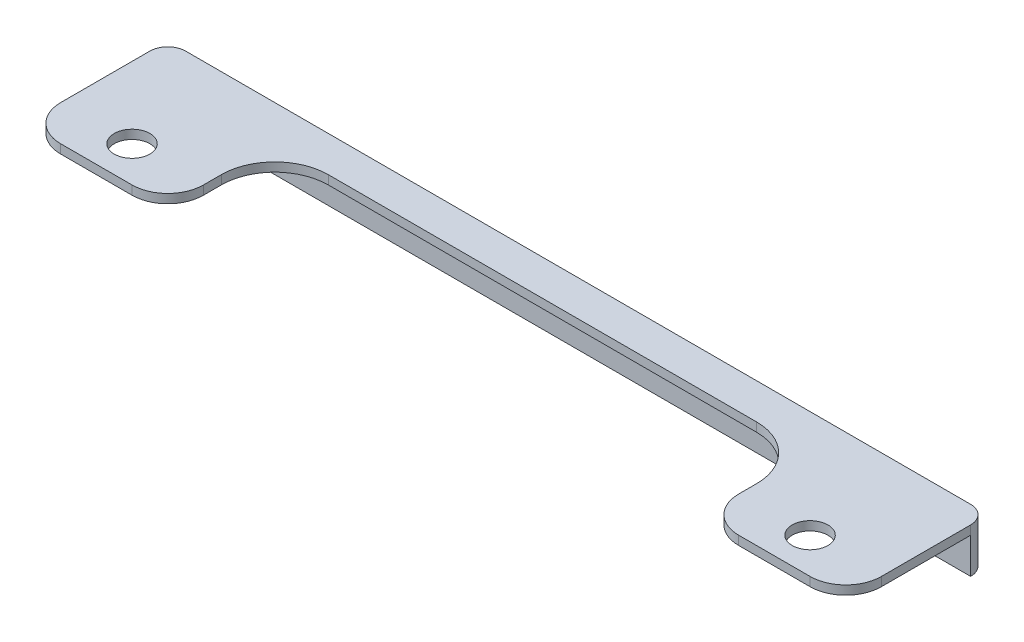
ISO-10303-21;
HEADER;
FILE_DESCRIPTION(('STEP AP214'),'2;1');
FILE_NAME('part.step','',(''),(''),'','','');
FILE_SCHEMA(('AUTOMOTIVE_DESIGN { 1 0 10303 214 1 1 1 1 }'));
ENDSEC;
DATA;
#1=APPLICATION_CONTEXT('core data for automotive mechanical design processes');
#2=APPLICATION_PROTOCOL_DEFINITION('international standard','automotive_design',2000,#1);
#3=PRODUCT_CONTEXT('',#1,'mechanical');
#4=PRODUCT('Part','Part','',(#3));
#5=PRODUCT_RELATED_PRODUCT_CATEGORY('part','',(#4));
#6=PRODUCT_DEFINITION_FORMATION('','',#4);
#7=PRODUCT_DEFINITION_CONTEXT('part definition',#1,'design');
#8=PRODUCT_DEFINITION('design','',#6,#7);
#9=PRODUCT_DEFINITION_SHAPE('','',#8);
#10=(LENGTH_UNIT() NAMED_UNIT(*) SI_UNIT(.MILLI.,.METRE.));
#11=(NAMED_UNIT(*) PLANE_ANGLE_UNIT() SI_UNIT($,.RADIAN.));
#12=(NAMED_UNIT(*) SI_UNIT($,.STERADIAN.) SOLID_ANGLE_UNIT());
#13=UNCERTAINTY_MEASURE_WITH_UNIT(LENGTH_MEASURE(1.E-05),#10,'distance_accuracy_value','');
#14=(GEOMETRIC_REPRESENTATION_CONTEXT(3) GLOBAL_UNCERTAINTY_ASSIGNED_CONTEXT((#13)) GLOBAL_UNIT_ASSIGNED_CONTEXT((#10,
#11,#12)) REPRESENTATION_CONTEXT('',''));
#15=CARTESIAN_POINT('',(0.,0.,0.));
#16=DIRECTION('',(0.,0.,1.));
#17=DIRECTION('',(1.,0.,0.));
#18=AXIS2_PLACEMENT_3D('',#15,#16,#17);
#19=CARTESIAN_POINT('',(0.,-40.,-103.273036008075));
#20=DIRECTION('',(0.,0.,1.));
#21=DIRECTION('',(1.,0.,0.));
#22=AXIS2_PLACEMENT_3D('',#19,#20,#21);
#23=PLANE('',#22);
#24=DIRECTION('',(1.,0.,0.));
#25=VECTOR('',#24,1.);
#26=CARTESIAN_POINT('',(0.,0.,-103.273036008075));
#27=LINE('',#26,#25);
#28=CARTESIAN_POINT('',(-73.0488390004261,0.,-103.273036008075));
#29=VERTEX_POINT('',#28);
#30=CARTESIAN_POINT('',(146.951160999574,0.,-103.273036008075));
#31=VERTEX_POINT('',#30);
#32=EDGE_CURVE('E289',#29,#31,#27,.T.);
#33=ORIENTED_EDGE('',*,*,#32,.T.);
#34=DIRECTION('',(0.,-1.,0.));
#35=VECTOR('',#34,1.);
#36=CARTESIAN_POINT('',(146.951160999574,-40.,-103.273036008075));
#37=LINE('',#36,#35);
#38=CARTESIAN_POINT('',(146.951160999574,-12.5,-103.273036008075));
#39=VERTEX_POINT('',#38);
#40=EDGE_CURVE('E292',#31,#39,#37,.T.);
#41=ORIENTED_EDGE('',*,*,#40,.T.);
#42=DIRECTION('',(1.,0.,0.));
#43=VECTOR('',#42,1.);
#44=CARTESIAN_POINT('',(0.,-12.5,-103.273036008075));
#45=LINE('',#44,#43);
#46=CARTESIAN_POINT('',(-73.0488390004261,-12.5,-103.273036008075));
#47=VERTEX_POINT('',#46);
#48=EDGE_CURVE('E282',#47,#39,#45,.T.);
#49=ORIENTED_EDGE('',*,*,#48,.F.);
#50=DIRECTION('',(0.,1.,0.));
#51=VECTOR('',#50,1.);
#52=CARTESIAN_POINT('',(-73.0488390004261,-40.,-103.273036008075));
#53=LINE('',#52,#51);
#54=EDGE_CURVE('E287',#47,#29,#53,.T.);
#55=ORIENTED_EDGE('',*,*,#54,.T.);
#56=EDGE_LOOP('',(#33,#41,#49,#55));
#57=FACE_BOUND('',#56,.T.);
#58=ADVANCED_FACE('F34',(#57),#23,.F.);
#59=CARTESIAN_POINT('',(0.,0.,-98.2730360080746));
#60=DIRECTION('',(0.,0.,1.));
#61=DIRECTION('',(1.,0.,0.));
#62=AXIS2_PLACEMENT_3D('',#59,#60,#61);
#63=PLANE('',#62);
#64=DIRECTION('',(0.,1.,0.));
#65=VECTOR('',#64,1.);
#66=CARTESIAN_POINT('',(-78.0488390004261,0.,-98.2730360080746));
#67=LINE('',#66,#65);
#68=CARTESIAN_POINT('',(-78.0488390004261,-12.5,-98.2730360080746));
#69=VERTEX_POINT('',#68);
#70=CARTESIAN_POINT('',(-78.0488390004261,-2.49999999999997,-98.2730360080746));
#71=VERTEX_POINT('',#70);
#72=EDGE_CURVE('E164',#69,#71,#67,.T.);
#73=ORIENTED_EDGE('',*,*,#72,.F.);
#74=DIRECTION('',(1.,0.,0.));
#75=VECTOR('',#74,1.);
#76=CARTESIAN_POINT('',(0.,-12.5,-98.2730360080746));
#77=LINE('',#76,#75);
#78=CARTESIAN_POINT('',(151.951160999574,-12.5,-98.2730360080746));
#79=VERTEX_POINT('',#78);
#80=EDGE_CURVE('E175',#69,#79,#77,.T.);
#81=ORIENTED_EDGE('',*,*,#80,.T.);
#82=DIRECTION('',(0.,-1.,0.));
#83=VECTOR('',#82,1.);
#84=CARTESIAN_POINT('',(151.951160999574,0.,-98.2730360080746));
#85=LINE('',#84,#83);
#86=CARTESIAN_POINT('',(151.951160999574,-2.49999999999997,-98.2730360080746));
#87=VERTEX_POINT('',#86);
#88=EDGE_CURVE('E165',#87,#79,#85,.T.);
#89=ORIENTED_EDGE('',*,*,#88,.F.);
#90=DIRECTION('',(-1.,0.,0.));
#91=VECTOR('',#90,1.);
#92=CARTESIAN_POINT('',(0.,-2.5,-98.2730360080746));
#93=LINE('',#92,#91);
#94=EDGE_CURVE('E172',#87,#71,#93,.T.);
#95=ORIENTED_EDGE('',*,*,#94,.T.);
#96=EDGE_LOOP('',(#73,#81,#89,#95));
#97=FACE_BOUND('',#96,.T.);
#98=ADVANCED_FACE('F171',(#97),#63,.T.);
#99=CARTESIAN_POINT('',(0.,0.,0.));
#100=DIRECTION('',(0.,1.,0.));
#101=DIRECTION('',(0.,0.,1.));
#102=AXIS2_PLACEMENT_3D('',#99,#100,#101);
#103=PLANE('',#102);
#104=CARTESIAN_POINT('',(131.951160999574,0.,-73.2730360080746));
#105=DIRECTION('',(0.,1.,0.));
#106=DIRECTION('',(0.,0.,1.));
#107=AXIS2_PLACEMENT_3D('',#104,#105,#106);
#108=CIRCLE('',#107,5.00000000000002);
#109=CARTESIAN_POINT('',(131.951160999574,0.,-68.2730360080745));
#110=VERTEX_POINT('',#109);
#111=EDGE_CURVE('E241',#110,#110,#108,.T.);
#112=ORIENTED_EDGE('',*,*,#111,.F.);
#113=EDGE_LOOP('',(#112));
#114=FACE_BOUND('',#113,.T.);
#115=CARTESIAN_POINT('',(-58.0488390004261,0.,-73.2730360080746));
#116=DIRECTION('',(0.,1.,0.));
#117=DIRECTION('',(0.,0.,1.));
#118=AXIS2_PLACEMENT_3D('',#115,#116,#117);
#119=CIRCLE('',#118,5.);
#120=CARTESIAN_POINT('',(-58.0488390004261,0.,-68.2730360080746));
#121=VERTEX_POINT('',#120);
#122=EDGE_CURVE('E574',#121,#121,#119,.T.);
#123=ORIENTED_EDGE('',*,*,#122,.F.);
#124=EDGE_LOOP('',(#123));
#125=FACE_BOUND('',#124,.T.);
#126=DIRECTION('',(0.,0.,-1.));
#127=VECTOR('',#126,1.);
#128=CARTESIAN_POINT('',(111.951160999575,0.,-7.76817228595287E-13));
#129=LINE('',#128,#127);
#130=CARTESIAN_POINT('',(111.951160999574,0.,-73.2730360080745));
#131=VERTEX_POINT('',#130);
#132=CARTESIAN_POINT('',(111.951160999574,0.,-78.273036008075));
#133=VERTEX_POINT('',#132);
#134=EDGE_CURVE('E268',#131,#133,#129,.T.);
#135=ORIENTED_EDGE('',*,*,#134,.F.);
#136=CARTESIAN_POINT('',(121.951160999574,0.,-73.2730360080746));
#137=DIRECTION('',(0.,1.,0.));
#138=DIRECTION('',(0.,0.,1.));
#139=AXIS2_PLACEMENT_3D('',#136,#137,#138);
#140=CIRCLE('',#139,10.);
#141=CARTESIAN_POINT('',(121.951160999574,0.,-63.2730360080746));
#142=VERTEX_POINT('',#141);
#143=EDGE_CURVE('E222',#131,#142,#140,.T.);
#144=ORIENTED_EDGE('',*,*,#143,.T.);
#145=DIRECTION('',(-1.,0.,0.));
#146=VECTOR('',#145,1.);
#147=CARTESIAN_POINT('',(-78.0488390004261,0.,-63.2730360080746));
#148=LINE('',#147,#146);
#149=CARTESIAN_POINT('',(141.951160999574,0.,-63.2730360080746));
#150=VERTEX_POINT('',#149);
#151=EDGE_CURVE('E240',#150,#142,#148,.T.);
#152=ORIENTED_EDGE('',*,*,#151,.F.);
#153=CARTESIAN_POINT('',(141.951160999574,0.,-73.2730360080746));
#154=DIRECTION('',(0.,1.,0.));
#155=DIRECTION('',(0.,0.,1.));
#156=AXIS2_PLACEMENT_3D('',#153,#154,#155);
#157=CIRCLE('',#156,10.);
#158=CARTESIAN_POINT('',(151.951160999574,0.,-73.2730360080746));
#159=VERTEX_POINT('',#158);
#160=EDGE_CURVE('E220',#150,#159,#157,.T.);
#161=ORIENTED_EDGE('',*,*,#160,.T.);
#162=DIRECTION('',(0.,0.,1.));
#163=VECTOR('',#162,1.);
#164=CARTESIAN_POINT('',(151.951160999574,0.,-108.83068140399));
#165=LINE('',#164,#163);
#166=CARTESIAN_POINT('',(151.951160999574,0.,-98.2730360080746));
#167=VERTEX_POINT('',#166);
#168=EDGE_CURVE('E338',#167,#159,#165,.T.);
#169=ORIENTED_EDGE('',*,*,#168,.F.);
#170=CARTESIAN_POINT('',(146.951160999574,0.,-98.2730360080746));
#171=DIRECTION('',(0.,1.,0.));
#172=DIRECTION('',(0.,0.,1.));
#173=AXIS2_PLACEMENT_3D('',#170,#171,#172);
#174=CIRCLE('',#173,5.);
#175=EDGE_CURVE('E189',#167,#31,#174,.T.);
#176=ORIENTED_EDGE('',*,*,#175,.T.);
#177=ORIENTED_EDGE('',*,*,#32,.F.);
#178=CARTESIAN_POINT('',(-73.0488390004261,0.,-98.2730360080746));
#179=DIRECTION('',(0.,1.,0.));
#180=DIRECTION('',(0.,0.,1.));
#181=AXIS2_PLACEMENT_3D('',#178,#179,#180);
#182=CIRCLE('',#181,5.);
#183=CARTESIAN_POINT('',(-78.0488390004261,0.,-98.2730360080746));
#184=VERTEX_POINT('',#183);
#185=EDGE_CURVE('E190',#29,#184,#182,.T.);
#186=ORIENTED_EDGE('',*,*,#185,.T.);
#187=DIRECTION('',(0.,0.,-1.));
#188=VECTOR('',#187,1.);
#189=CARTESIAN_POINT('',(-78.0488390004261,0.,-104.16866880405));
#190=LINE('',#189,#188);
#191=CARTESIAN_POINT('',(-78.0488390004261,0.,-73.2730360080746));
#192=VERTEX_POINT('',#191);
#193=EDGE_CURVE('E177',#192,#184,#190,.T.);
#194=ORIENTED_EDGE('',*,*,#193,.F.);
#195=CARTESIAN_POINT('',(-68.0488390004261,0.,-73.2730360080746));
#196=DIRECTION('',(0.,1.,0.));
#197=DIRECTION('',(0.,0.,1.));
#198=AXIS2_PLACEMENT_3D('',#195,#196,#197);
#199=CIRCLE('',#198,10.);
#200=CARTESIAN_POINT('',(-68.0488390004261,0.,-63.2730360080746));
#201=VERTEX_POINT('',#200);
#202=EDGE_CURVE('E55',#192,#201,#199,.T.);
#203=ORIENTED_EDGE('',*,*,#202,.T.);
#204=CARTESIAN_POINT('',(-48.0488390004261,0.,-63.2730360080746));
#205=VERTEX_POINT('',#204);
#206=EDGE_CURVE('E233',#205,#201,#148,.T.);
#207=ORIENTED_EDGE('',*,*,#206,.F.);
#208=CARTESIAN_POINT('',(-48.0488390004261,0.,-73.2730360080746));
#209=DIRECTION('',(0.,1.,0.));
#210=DIRECTION('',(0.,0.,1.));
#211=AXIS2_PLACEMENT_3D('',#208,#209,#210);
#212=CIRCLE('',#211,10.);
#213=CARTESIAN_POINT('',(-38.0488390004261,0.,-73.2730360080746));
#214=VERTEX_POINT('',#213);
#215=EDGE_CURVE('E49',#205,#214,#212,.T.);
#216=ORIENTED_EDGE('',*,*,#215,.T.);
#217=DIRECTION('',(0.,0.,-1.));
#218=VECTOR('',#217,1.);
#219=CARTESIAN_POINT('',(-38.0488390004261,0.,0.));
#220=LINE('',#219,#218);
#221=CARTESIAN_POINT('',(-38.0488390004261,0.,-78.2730360080745));
#222=VERTEX_POINT('',#221);
#223=EDGE_CURVE('E251',#214,#222,#220,.T.);
#224=ORIENTED_EDGE('',*,*,#223,.T.);
#225=CARTESIAN_POINT('',(-23.0488390004261,0.,-78.2730360080746));
#226=DIRECTION('',(0.,1.,0.));
#227=DIRECTION('',(0.,0.,1.));
#228=AXIS2_PLACEMENT_3D('',#225,#226,#227);
#229=CIRCLE('',#228,15.);
#230=CARTESIAN_POINT('',(-23.048839000426,0.,-93.2730360080746));
#231=VERTEX_POINT('',#230);
#232=EDGE_CURVE('E260',#222,#231,#229,.F.);
#233=ORIENTED_EDGE('',*,*,#232,.T.);
#234=DIRECTION('',(1.,0.,0.));
#235=VECTOR('',#234,1.);
#236=CARTESIAN_POINT('',(-3.19291105804638E-13,0.,-93.2730360080747));
#237=LINE('',#236,#235);
#238=CARTESIAN_POINT('',(96.9511609995742,0.,-93.273036008075));
#239=VERTEX_POINT('',#238);
#240=EDGE_CURVE('E256',#231,#239,#237,.T.);
#241=ORIENTED_EDGE('',*,*,#240,.T.);
#242=CARTESIAN_POINT('',(96.9511609995743,0.,-78.273036008075));
#243=DIRECTION('',(0.,1.,0.));
#244=DIRECTION('',(0.,0.,1.));
#245=AXIS2_PLACEMENT_3D('',#242,#243,#244);
#246=CIRCLE('',#245,15.);
#247=EDGE_CURVE('E184',#239,#133,#246,.F.);
#248=ORIENTED_EDGE('',*,*,#247,.T.);
#249=EDGE_LOOP('',(#135,#144,#152,#161,#169,#176,#177,#186,#194,#203,#207,#216,#224,#233,#241,#248));
#250=FACE_BOUND('',#249,.T.);
#251=ADVANCED_FACE('F239',(#114,#125,#250),#103,.T.);
#252=CARTESIAN_POINT('',(0.,-2.5,-98.2730360080746));
#253=DIRECTION('',(0.,1.,0.));
#254=DIRECTION('',(-1.,0.,0.));
#255=AXIS2_PLACEMENT_3D('',#252,#253,#254);
#256=PLANE('',#255);
#257=CARTESIAN_POINT('',(131.951160999574,-2.49999999999998,-73.2730360080746));
#258=DIRECTION('',(0.,-1.,0.));
#259=DIRECTION('',(1.,0.,0.));
#260=AXIS2_PLACEMENT_3D('',#257,#258,#259);
#261=CIRCLE('',#260,5.00000000000002);
#262=CARTESIAN_POINT('',(136.951160999574,-2.49999999999998,-73.2730360080746));
#263=VERTEX_POINT('',#262);
#264=EDGE_CURVE('E573',#263,#263,#261,.T.);
#265=ORIENTED_EDGE('',*,*,#264,.F.);
#266=EDGE_LOOP('',(#265));
#267=FACE_BOUND('',#266,.T.);
#268=CARTESIAN_POINT('',(-58.0488390004261,-2.50000000000001,-73.2730360080746));
#269=DIRECTION('',(0.,-1.,0.));
#270=DIRECTION('',(1.,0.,0.));
#271=AXIS2_PLACEMENT_3D('',#268,#269,#270);
#272=CIRCLE('',#271,5.);
#273=CARTESIAN_POINT('',(-53.0488390004261,-2.5,-73.2730360080746));
#274=VERTEX_POINT('',#273);
#275=EDGE_CURVE('E575',#274,#274,#272,.T.);
#276=ORIENTED_EDGE('',*,*,#275,.F.);
#277=EDGE_LOOP('',(#276));
#278=FACE_BOUND('',#277,.T.);
#279=DIRECTION('',(-1.,0.,0.));
#280=VECTOR('',#279,1.);
#281=CARTESIAN_POINT('',(0.,-2.5,-63.2730360080746));
#282=LINE('',#281,#280);
#283=CARTESIAN_POINT('',(141.951160999574,-2.49999999999998,-63.2730360080746));
#284=VERTEX_POINT('',#283);
#285=CARTESIAN_POINT('',(121.951160999574,-2.49999999999998,-63.2730360080746));
#286=VERTEX_POINT('',#285);
#287=EDGE_CURVE('E333',#284,#286,#282,.T.);
#288=ORIENTED_EDGE('',*,*,#287,.T.);
#289=CARTESIAN_POINT('',(121.951160999574,-2.49999999999998,-73.2730360080746));
#290=DIRECTION('',(0.,1.,0.));
#291=DIRECTION('',(-1.,0.,0.));
#292=AXIS2_PLACEMENT_3D('',#289,#290,#291);
#293=CIRCLE('',#292,10.);
#294=CARTESIAN_POINT('',(111.951160999574,-2.5,-73.2730360080745));
#295=VERTEX_POINT('',#294);
#296=EDGE_CURVE('E214',#286,#295,#293,.F.);
#297=ORIENTED_EDGE('',*,*,#296,.T.);
#298=DIRECTION('',(0.,0.,-1.));
#299=VECTOR('',#298,1.);
#300=CARTESIAN_POINT('',(111.951160999575,-2.5,-7.76817228595287E-13));
#301=LINE('',#300,#299);
#302=CARTESIAN_POINT('',(111.951160999574,-2.5,-78.273036008075));
#303=VERTEX_POINT('',#302);
#304=EDGE_CURVE('E255',#295,#303,#301,.T.);
#305=ORIENTED_EDGE('',*,*,#304,.T.);
#306=CARTESIAN_POINT('',(96.9511609995743,-2.5,-78.273036008075));
#307=DIRECTION('',(0.,1.,0.));
#308=DIRECTION('',(0.,0.,1.));
#309=AXIS2_PLACEMENT_3D('',#306,#307,#308);
#310=CIRCLE('',#309,15.);
#311=CARTESIAN_POINT('',(96.9511609995742,-2.5,-93.273036008075));
#312=VERTEX_POINT('',#311);
#313=EDGE_CURVE('E272',#312,#303,#310,.F.);
#314=ORIENTED_EDGE('',*,*,#313,.F.);
#315=DIRECTION('',(1.,0.,0.));
#316=VECTOR('',#315,1.);
#317=CARTESIAN_POINT('',(0.,-2.50000000000002,-93.2730360080747));
#318=LINE('',#317,#316);
#319=CARTESIAN_POINT('',(-23.048839000426,-2.5,-93.2730360080746));
#320=VERTEX_POINT('',#319);
#321=EDGE_CURVE('E258',#320,#312,#318,.T.);
#322=ORIENTED_EDGE('',*,*,#321,.F.);
#323=CARTESIAN_POINT('',(-23.0488390004261,-2.5,-78.2730360080746));
#324=DIRECTION('',(0.,1.,0.));
#325=DIRECTION('',(0.,0.,1.));
#326=AXIS2_PLACEMENT_3D('',#323,#324,#325);
#327=CIRCLE('',#326,15.);
#328=CARTESIAN_POINT('',(-38.0488390004261,-2.5,-78.2730360080745));
#329=VERTEX_POINT('',#328);
#330=EDGE_CURVE('E254',#329,#320,#327,.F.);
#331=ORIENTED_EDGE('',*,*,#330,.F.);
#332=DIRECTION('',(0.,0.,1.));
#333=VECTOR('',#332,1.);
#334=CARTESIAN_POINT('',(-38.0488390004261,-2.5,-98.2730360080746));
#335=LINE('',#334,#333);
#336=CARTESIAN_POINT('',(-38.0488390004261,-2.5,-73.2730360080746));
#337=VERTEX_POINT('',#336);
#338=EDGE_CURVE('E250',#329,#337,#335,.T.);
#339=ORIENTED_EDGE('',*,*,#338,.T.);
#340=CARTESIAN_POINT('',(-48.0488390004261,-2.5,-73.2730360080746));
#341=DIRECTION('',(0.,1.,0.));
#342=DIRECTION('',(-1.,0.,0.));
#343=AXIS2_PLACEMENT_3D('',#340,#341,#342);
#344=CIRCLE('',#343,10.);
#345=CARTESIAN_POINT('',(-48.0488390004261,-2.5,-63.2730360080746));
#346=VERTEX_POINT('',#345);
#347=EDGE_CURVE('E210',#337,#346,#344,.F.);
#348=ORIENTED_EDGE('',*,*,#347,.T.);
#349=CARTESIAN_POINT('',(-68.0488390004261,-2.50000000000001,-63.2730360080746));
#350=VERTEX_POINT('',#349);
#351=EDGE_CURVE('E236',#346,#350,#282,.T.);
#352=ORIENTED_EDGE('',*,*,#351,.T.);
#353=CARTESIAN_POINT('',(-68.0488390004261,-2.5,-73.2730360080746));
#354=DIRECTION('',(0.,1.,0.));
#355=DIRECTION('',(-1.,0.,0.));
#356=AXIS2_PLACEMENT_3D('',#353,#354,#355);
#357=CIRCLE('',#356,10.);
#358=CARTESIAN_POINT('',(-78.0488390004261,-2.50000000000001,-73.2730360080746));
#359=VERTEX_POINT('',#358);
#360=EDGE_CURVE('E208',#350,#359,#357,.F.);
#361=ORIENTED_EDGE('',*,*,#360,.T.);
#362=DIRECTION('',(0.,0.,-1.));
#363=VECTOR('',#362,1.);
#364=CARTESIAN_POINT('',(-78.0488390004261,-2.50000000000001,-98.2730360080745));
#365=LINE('',#364,#363);
#366=EDGE_CURVE('E182',#359,#71,#365,.T.);
#367=ORIENTED_EDGE('',*,*,#366,.T.);
#368=ORIENTED_EDGE('',*,*,#94,.F.);
#369=DIRECTION('',(0.,0.,1.));
#370=VECTOR('',#369,1.);
#371=CARTESIAN_POINT('',(151.951160999574,-2.49999999999998,-98.2730360080746));
#372=LINE('',#371,#370);
#373=CARTESIAN_POINT('',(151.951160999574,-2.49999999999998,-73.2730360080746));
#374=VERTEX_POINT('',#373);
#375=EDGE_CURVE('E152',#87,#374,#372,.T.);
#376=ORIENTED_EDGE('',*,*,#375,.T.);
#377=CARTESIAN_POINT('',(141.951160999574,-2.49999999999997,-73.2730360080746));
#378=DIRECTION('',(0.,1.,0.));
#379=DIRECTION('',(-1.,0.,0.));
#380=AXIS2_PLACEMENT_3D('',#377,#378,#379);
#381=CIRCLE('',#380,10.);
#382=EDGE_CURVE('E212',#374,#284,#381,.F.);
#383=ORIENTED_EDGE('',*,*,#382,.T.);
#384=EDGE_LOOP('',(#288,#297,#305,#314,#322,#331,#339,#348,#352,#361,#367,#368,#376,#383));
#385=FACE_BOUND('',#384,.T.);
#386=ADVANCED_FACE('F180',(#267,#278,#385),#256,.F.);
#387=CARTESIAN_POINT('',(-3.19291105804638E-13,-40.,-93.2730360080747));
#388=DIRECTION('',(0.,0.,1.));
#389=DIRECTION('',(1.,0.,0.));
#390=AXIS2_PLACEMENT_3D('',#387,#388,#389);
#391=PLANE('',#390);
#392=ORIENTED_EDGE('',*,*,#240,.F.);
#393=DIRECTION('',(0.,1.,0.));
#394=VECTOR('',#393,1.);
#395=CARTESIAN_POINT('',(-23.048839000426,-2.5,-93.2730360080746));
#396=LINE('',#395,#394);
#397=EDGE_CURVE('E279',#320,#231,#396,.T.);
#398=ORIENTED_EDGE('',*,*,#397,.F.);
#399=ORIENTED_EDGE('',*,*,#321,.T.);
#400=DIRECTION('',(0.,1.,0.));
#401=VECTOR('',#400,1.);
#402=CARTESIAN_POINT('',(96.9511609995742,-2.5,-93.273036008075));
#403=LINE('',#402,#401);
#404=EDGE_CURVE('E265',#312,#239,#403,.T.);
#405=ORIENTED_EDGE('',*,*,#404,.T.);
#406=EDGE_LOOP('',(#392,#398,#399,#405));
#407=FACE_BOUND('',#406,.T.);
#408=ADVANCED_FACE('F323',(#407),#391,.T.);
#409=CARTESIAN_POINT('',(111.951160999575,-40.,-7.76817228595287E-13));
#410=DIRECTION('',(1.,0.,0.));
#411=DIRECTION('',(0.,0.,-1.));
#412=AXIS2_PLACEMENT_3D('',#409,#410,#411);
#413=PLANE('',#412);
#414=ORIENTED_EDGE('',*,*,#304,.F.);
#415=DIRECTION('',(0.,-1.,0.));
#416=VECTOR('',#415,1.);
#417=CARTESIAN_POINT('',(111.951160999574,-40.,-73.2730360080745));
#418=LINE('',#417,#416);
#419=EDGE_CURVE('E216',#295,#131,#418,.F.);
#420=ORIENTED_EDGE('',*,*,#419,.T.);
#421=ORIENTED_EDGE('',*,*,#134,.T.);
#422=DIRECTION('',(0.,1.,0.));
#423=VECTOR('',#422,1.);
#424=CARTESIAN_POINT('',(111.951160999574,-2.5,-78.273036008075));
#425=LINE('',#424,#423);
#426=EDGE_CURVE('E269',#303,#133,#425,.T.);
#427=ORIENTED_EDGE('',*,*,#426,.F.);
#428=EDGE_LOOP('',(#414,#420,#421,#427));
#429=FACE_BOUND('',#428,.T.);
#430=ADVANCED_FACE('F311',(#429),#413,.F.);
#431=CARTESIAN_POINT('',(-38.0488390004261,-40.,0.));
#432=DIRECTION('',(1.,0.,0.));
#433=DIRECTION('',(0.,0.,-1.));
#434=AXIS2_PLACEMENT_3D('',#431,#432,#433);
#435=PLANE('',#434);
#436=ORIENTED_EDGE('',*,*,#223,.F.);
#437=DIRECTION('',(0.,-1.,0.));
#438=VECTOR('',#437,1.);
#439=CARTESIAN_POINT('',(-38.0488390004261,-2.5,-73.2730360080746));
#440=LINE('',#439,#438);
#441=EDGE_CURVE('E225',#214,#337,#440,.T.);
#442=ORIENTED_EDGE('',*,*,#441,.T.);
#443=ORIENTED_EDGE('',*,*,#338,.F.);
#444=DIRECTION('',(0.,1.,0.));
#445=VECTOR('',#444,1.);
#446=CARTESIAN_POINT('',(-38.0488390004261,-2.5,-78.2730360080745));
#447=LINE('',#446,#445);
#448=EDGE_CURVE('E277',#329,#222,#447,.T.);
#449=ORIENTED_EDGE('',*,*,#448,.T.);
#450=EDGE_LOOP('',(#436,#442,#443,#449));
#451=FACE_BOUND('',#450,.T.);
#452=ADVANCED_FACE('F248',(#451),#435,.T.);
#453=CARTESIAN_POINT('',(96.9511609995743,-2.5,-78.273036008075));
#454=DIRECTION('',(0.,1.,0.));
#455=DIRECTION('',(0.,0.,1.));
#456=AXIS2_PLACEMENT_3D('',#453,#454,#455);
#457=CYLINDRICAL_SURFACE('',#456,15.);
#458=ORIENTED_EDGE('',*,*,#247,.F.);
#459=ORIENTED_EDGE('',*,*,#404,.F.);
#460=ORIENTED_EDGE('',*,*,#313,.T.);
#461=ORIENTED_EDGE('',*,*,#426,.T.);
#462=EDGE_LOOP('',(#458,#459,#460,#461));
#463=FACE_BOUND('',#462,.T.);
#464=ADVANCED_FACE('F316',(#463),#457,.F.);
#465=CARTESIAN_POINT('',(-23.0488390004261,-2.5,-78.2730360080746));
#466=DIRECTION('',(0.,1.,0.));
#467=DIRECTION('',(0.,0.,1.));
#468=AXIS2_PLACEMENT_3D('',#465,#466,#467);
#469=CYLINDRICAL_SURFACE('',#468,15.);
#470=ORIENTED_EDGE('',*,*,#232,.F.);
#471=ORIENTED_EDGE('',*,*,#448,.F.);
#472=ORIENTED_EDGE('',*,*,#330,.T.);
#473=ORIENTED_EDGE('',*,*,#397,.T.);
#474=EDGE_LOOP('',(#470,#471,#472,#473));
#475=FACE_BOUND('',#474,.T.);
#476=ADVANCED_FACE('F453',(#475),#469,.F.);
#477=CARTESIAN_POINT('',(0.,-12.5,-108.273036008075));
#478=DIRECTION('',(0.,-1.,0.));
#479=DIRECTION('',(0.,0.,-1.));
#480=AXIS2_PLACEMENT_3D('',#477,#478,#479);
#481=PLANE('',#480);
#482=ORIENTED_EDGE('',*,*,#48,.T.);
#483=CARTESIAN_POINT('',(146.951160999574,-12.5,-98.2730360080746));
#484=DIRECTION('',(0.,-1.,0.));
#485=DIRECTION('',(0.,0.,-1.));
#486=AXIS2_PLACEMENT_3D('',#483,#484,#485);
#487=CIRCLE('',#486,5.);
#488=EDGE_CURVE('E191',#39,#79,#487,.T.);
#489=ORIENTED_EDGE('',*,*,#488,.T.);
#490=ORIENTED_EDGE('',*,*,#80,.F.);
#491=CARTESIAN_POINT('',(-73.0488390004261,-12.5,-98.2730360080746));
#492=DIRECTION('',(0.,-1.,0.));
#493=DIRECTION('',(0.,0.,-1.));
#494=AXIS2_PLACEMENT_3D('',#491,#492,#493);
#495=CIRCLE('',#494,5.);
#496=EDGE_CURVE('E195',#69,#47,#495,.T.);
#497=ORIENTED_EDGE('',*,*,#496,.T.);
#498=EDGE_LOOP('',(#482,#489,#490,#497));
#499=FACE_BOUND('',#498,.T.);
#500=ADVANCED_FACE('F297',(#499),#481,.T.);
#501=CARTESIAN_POINT('',(151.951160999574,-50.,-108.83068140399));
#502=DIRECTION('',(-1.,0.,0.));
#503=DIRECTION('',(0.,0.,1.));
#504=AXIS2_PLACEMENT_3D('',#501,#502,#503);
#505=PLANE('',#504);
#506=ORIENTED_EDGE('',*,*,#168,.T.);
#507=DIRECTION('',(0.,1.,0.));
#508=VECTOR('',#507,1.);
#509=CARTESIAN_POINT('',(151.951160999574,-50.,-73.2730360080746));
#510=LINE('',#509,#508);
#511=EDGE_CURVE('E160',#159,#374,#510,.F.);
#512=ORIENTED_EDGE('',*,*,#511,.T.);
#513=ORIENTED_EDGE('',*,*,#375,.F.);
#514=DIRECTION('',(0.,-1.,0.));
#515=VECTOR('',#514,1.);
#516=CARTESIAN_POINT('',(151.951160999574,-50.,-98.2730360080746));
#517=LINE('',#516,#515);
#518=EDGE_CURVE('E157',#87,#167,#517,.F.);
#519=ORIENTED_EDGE('',*,*,#518,.T.);
#520=EDGE_LOOP('',(#506,#512,#513,#519));
#521=FACE_BOUND('',#520,.T.);
#522=ADVANCED_FACE('F155',(#521),#505,.F.);
#523=CARTESIAN_POINT('',(-78.0488390004261,-50.,-104.16866880405));
#524=DIRECTION('',(1.,0.,0.));
#525=DIRECTION('',(0.,0.,-1.));
#526=AXIS2_PLACEMENT_3D('',#523,#524,#525);
#527=PLANE('',#526);
#528=ORIENTED_EDGE('',*,*,#366,.F.);
#529=DIRECTION('',(0.,1.,0.));
#530=VECTOR('',#529,1.);
#531=CARTESIAN_POINT('',(-78.0488390004261,-50.,-73.2730360080746));
#532=LINE('',#531,#530);
#533=EDGE_CURVE('E11',#359,#192,#532,.T.);
#534=ORIENTED_EDGE('',*,*,#533,.T.);
#535=ORIENTED_EDGE('',*,*,#193,.T.);
#536=DIRECTION('',(0.,1.,0.));
#537=VECTOR('',#536,1.);
#538=CARTESIAN_POINT('',(-78.0488390004261,-50.,-98.2730360080746));
#539=LINE('',#538,#537);
#540=EDGE_CURVE('E200',#184,#71,#539,.F.);
#541=ORIENTED_EDGE('',*,*,#540,.T.);
#542=EDGE_LOOP('',(#528,#534,#535,#541));
#543=FACE_BOUND('',#542,.T.);
#544=ADVANCED_FACE('F445',(#543),#527,.F.);
#545=CARTESIAN_POINT('',(-78.0488390004261,-50.,-63.2730360080746));
#546=DIRECTION('',(0.,0.,-1.));
#547=DIRECTION('',(-1.,0.,0.));
#548=AXIS2_PLACEMENT_3D('',#545,#546,#547);
#549=PLANE('',#548);
#550=ORIENTED_EDGE('',*,*,#351,.F.);
#551=DIRECTION('',(0.,-1.,0.));
#552=VECTOR('',#551,1.);
#553=CARTESIAN_POINT('',(-48.0488390004261,0.,-63.2730360080746));
#554=LINE('',#553,#552);
#555=EDGE_CURVE('E42',#346,#205,#554,.F.);
#556=ORIENTED_EDGE('',*,*,#555,.T.);
#557=ORIENTED_EDGE('',*,*,#206,.T.);
#558=DIRECTION('',(0.,1.,0.));
#559=VECTOR('',#558,1.);
#560=CARTESIAN_POINT('',(-68.0488390004261,-50.,-63.2730360080746));
#561=LINE('',#560,#559);
#562=EDGE_CURVE('E228',#201,#350,#561,.F.);
#563=ORIENTED_EDGE('',*,*,#562,.T.);
#564=EDGE_LOOP('',(#550,#556,#557,#563));
#565=FACE_BOUND('',#564,.T.);
#566=ADVANCED_FACE('F232',(#565),#549,.F.);
#567=ORIENTED_EDGE('',*,*,#151,.T.);
#568=DIRECTION('',(0.,-1.,0.));
#569=VECTOR('',#568,1.);
#570=CARTESIAN_POINT('',(121.951160999574,-50.,-63.2730360080746));
#571=LINE('',#570,#569);
#572=EDGE_CURVE('E205',#142,#286,#571,.T.);
#573=ORIENTED_EDGE('',*,*,#572,.T.);
#574=ORIENTED_EDGE('',*,*,#287,.F.);
#575=DIRECTION('',(0.,1.,0.));
#576=VECTOR('',#575,1.);
#577=CARTESIAN_POINT('',(141.951160999574,-50.,-63.2730360080746));
#578=LINE('',#577,#576);
#579=EDGE_CURVE('E202',#284,#150,#578,.T.);
#580=ORIENTED_EDGE('',*,*,#579,.T.);
#581=EDGE_LOOP('',(#567,#573,#574,#580));
#582=FACE_BOUND('',#581,.T.);
#583=ADVANCED_FACE('F330',(#582),#549,.F.);
#584=CARTESIAN_POINT('',(146.951160999574,-40.,-98.2730360080746));
#585=DIRECTION('',(0.,-1.,0.));
#586=DIRECTION('',(0.,0.,-1.));
#587=AXIS2_PLACEMENT_3D('',#584,#585,#586);
#588=CYLINDRICAL_SURFACE('',#587,5.);
#589=ORIENTED_EDGE('',*,*,#518,.F.);
#590=ORIENTED_EDGE('',*,*,#88,.T.);
#591=ORIENTED_EDGE('',*,*,#488,.F.);
#592=ORIENTED_EDGE('',*,*,#40,.F.);
#593=ORIENTED_EDGE('',*,*,#175,.F.);
#594=EDGE_LOOP('',(#589,#590,#591,#592,#593));
#595=FACE_BOUND('',#594,.T.);
#596=ADVANCED_FACE('F187',(#595),#588,.T.);
#597=CARTESIAN_POINT('',(-73.0488390004261,-40.,-98.2730360080746));
#598=DIRECTION('',(0.,1.,0.));
#599=DIRECTION('',(0.,0.,1.));
#600=AXIS2_PLACEMENT_3D('',#597,#598,#599);
#601=CYLINDRICAL_SURFACE('',#600,5.);
#602=ORIENTED_EDGE('',*,*,#72,.T.);
#603=ORIENTED_EDGE('',*,*,#540,.F.);
#604=ORIENTED_EDGE('',*,*,#185,.F.);
#605=ORIENTED_EDGE('',*,*,#54,.F.);
#606=ORIENTED_EDGE('',*,*,#496,.F.);
#607=EDGE_LOOP('',(#602,#603,#604,#605,#606));
#608=FACE_BOUND('',#607,.T.);
#609=ADVANCED_FACE('F303',(#608),#601,.T.);
#610=CARTESIAN_POINT('',(121.951160999574,-50.,-73.2730360080746));
#611=DIRECTION('',(0.,-1.,0.));
#612=DIRECTION('',(0.,0.,-1.));
#613=AXIS2_PLACEMENT_3D('',#610,#611,#612);
#614=CYLINDRICAL_SURFACE('',#613,10.);
#615=ORIENTED_EDGE('',*,*,#143,.F.);
#616=ORIENTED_EDGE('',*,*,#419,.F.);
#617=ORIENTED_EDGE('',*,*,#296,.F.);
#618=ORIENTED_EDGE('',*,*,#572,.F.);
#619=EDGE_LOOP('',(#615,#616,#617,#618));
#620=FACE_BOUND('',#619,.T.);
#621=ADVANCED_FACE('F325',(#620),#614,.T.);
#622=CARTESIAN_POINT('',(141.951160999574,-50.,-73.2730360080746));
#623=DIRECTION('',(0.,1.,0.));
#624=DIRECTION('',(0.,0.,1.));
#625=AXIS2_PLACEMENT_3D('',#622,#623,#624);
#626=CYLINDRICAL_SURFACE('',#625,10.);
#627=ORIENTED_EDGE('',*,*,#382,.F.);
#628=ORIENTED_EDGE('',*,*,#511,.F.);
#629=ORIENTED_EDGE('',*,*,#160,.F.);
#630=ORIENTED_EDGE('',*,*,#579,.F.);
#631=EDGE_LOOP('',(#627,#628,#629,#630));
#632=FACE_BOUND('',#631,.T.);
#633=ADVANCED_FACE('F342',(#632),#626,.T.);
#634=CARTESIAN_POINT('',(-48.0488390004261,-40.,-73.2730360080746));
#635=DIRECTION('',(0.,1.,0.));
#636=DIRECTION('',(0.,0.,1.));
#637=AXIS2_PLACEMENT_3D('',#634,#635,#636);
#638=CYLINDRICAL_SURFACE('',#637,10.);
#639=ORIENTED_EDGE('',*,*,#215,.F.);
#640=ORIENTED_EDGE('',*,*,#555,.F.);
#641=ORIENTED_EDGE('',*,*,#347,.F.);
#642=ORIENTED_EDGE('',*,*,#441,.F.);
#643=EDGE_LOOP('',(#639,#640,#641,#642));
#644=FACE_BOUND('',#643,.T.);
#645=ADVANCED_FACE('F244',(#644),#638,.T.);
#646=CARTESIAN_POINT('',(-68.0488390004261,-50.,-73.2730360080746));
#647=DIRECTION('',(0.,1.,0.));
#648=DIRECTION('',(0.,0.,1.));
#649=AXIS2_PLACEMENT_3D('',#646,#647,#648);
#650=CYLINDRICAL_SURFACE('',#649,10.);
#651=ORIENTED_EDGE('',*,*,#360,.F.);
#652=ORIENTED_EDGE('',*,*,#562,.F.);
#653=ORIENTED_EDGE('',*,*,#202,.F.);
#654=ORIENTED_EDGE('',*,*,#533,.F.);
#655=EDGE_LOOP('',(#651,#652,#653,#654));
#656=FACE_BOUND('',#655,.T.);
#657=ADVANCED_FACE('F36',(#656),#650,.T.);
#658=CARTESIAN_POINT('',(-58.0488390004261,47.5,-73.2730360080746));
#659=DIRECTION('',(0.,-1.,0.));
#660=DIRECTION('',(1.,0.,0.));
#661=AXIS2_PLACEMENT_3D('',#658,#659,#660);
#662=CYLINDRICAL_SURFACE('',#661,5.);
#663=ORIENTED_EDGE('',*,*,#122,.T.);
#664=EDGE_LOOP('',(#663));
#665=FACE_BOUND('',#664,.T.);
#666=ORIENTED_EDGE('',*,*,#275,.T.);
#667=EDGE_LOOP('',(#666));
#668=FACE_BOUND('',#667,.T.);
#669=ADVANCED_FACE('F395',(#665,#668),#662,.F.);
#670=CARTESIAN_POINT('',(131.951160999574,47.5,-73.2730360080746));
#671=DIRECTION('',(0.,-1.,0.));
#672=DIRECTION('',(1.,0.,0.));
#673=AXIS2_PLACEMENT_3D('',#670,#671,#672);
#674=CYLINDRICAL_SURFACE('',#673,5.00000000000002);
#675=ORIENTED_EDGE('',*,*,#111,.T.);
#676=EDGE_LOOP('',(#675));
#677=FACE_BOUND('',#676,.T.);
#678=ORIENTED_EDGE('',*,*,#264,.T.);
#679=EDGE_LOOP('',(#678));
#680=FACE_BOUND('',#679,.T.);
#681=ADVANCED_FACE('F426',(#677,#680),#674,.F.);
#682=CLOSED_SHELL('',(#58,#98,#251,#386,#408,#430,#452,#464,#476,#500,#522,#544,#566,#583,#596,
#609,#621,#633,#645,#657,#669,#681));
#683=MANIFOLD_SOLID_BREP('B2',#682);
#684=ADVANCED_BREP_SHAPE_REPRESENTATION('',(#18,#683),#14);
#685=SHAPE_DEFINITION_REPRESENTATION(#9,#684);
ENDSEC;
END-ISO-10303-21;
